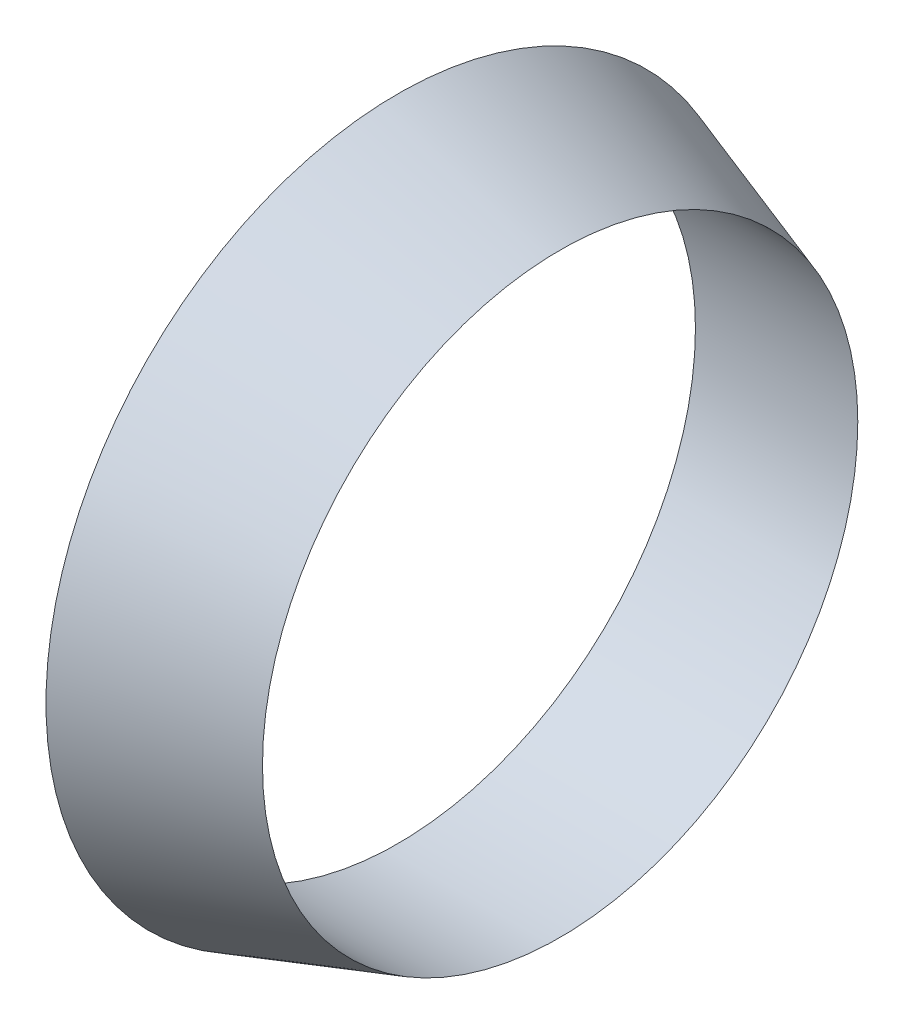
ISO-10303-21;
HEADER;
FILE_DESCRIPTION(('STEP AP214'),'2;1');
FILE_NAME('part.step','',(''),(''),'','','');
FILE_SCHEMA(('AUTOMOTIVE_DESIGN { 1 0 10303 214 1 1 1 1 }'));
ENDSEC;
DATA;
#1=APPLICATION_CONTEXT('core data for automotive mechanical design processes');
#2=APPLICATION_PROTOCOL_DEFINITION('international standard','automotive_design',2000,#1);
#3=PRODUCT_CONTEXT('',#1,'mechanical');
#4=PRODUCT('Part','Part','',(#3));
#5=PRODUCT_RELATED_PRODUCT_CATEGORY('part','',(#4));
#6=PRODUCT_DEFINITION_FORMATION('','',#4);
#7=PRODUCT_DEFINITION_CONTEXT('part definition',#1,'design');
#8=PRODUCT_DEFINITION('design','',#6,#7);
#9=PRODUCT_DEFINITION_SHAPE('','',#8);
#10=(LENGTH_UNIT() NAMED_UNIT(*) SI_UNIT(.MILLI.,.METRE.));
#11=(NAMED_UNIT(*) PLANE_ANGLE_UNIT() SI_UNIT($,.RADIAN.));
#12=(NAMED_UNIT(*) SI_UNIT($,.STERADIAN.) SOLID_ANGLE_UNIT());
#13=UNCERTAINTY_MEASURE_WITH_UNIT(LENGTH_MEASURE(1.E-05),#10,'distance_accuracy_value','');
#14=(GEOMETRIC_REPRESENTATION_CONTEXT(3) GLOBAL_UNCERTAINTY_ASSIGNED_CONTEXT((#13)) GLOBAL_UNIT_ASSIGNED_CONTEXT((#10,
#11,#12)) REPRESENTATION_CONTEXT('',''));
#15=CARTESIAN_POINT('',(0.,0.,0.));
#16=DIRECTION('',(0.,0.,1.));
#17=DIRECTION('',(1.,0.,0.));
#18=AXIS2_PLACEMENT_3D('',#15,#16,#17);
#19=CARTESIAN_POINT('',(0.,0.,0.));
#20=DIRECTION('',(1.,0.,0.));
#21=DIRECTION('',(0.,0.,-1.));
#22=AXIS2_PLACEMENT_3D('',#19,#20,#21);
#23=PLANE('',#22);
#24=CARTESIAN_POINT('',(0.,0.,0.));
#25=DIRECTION('',(1.,0.,0.));
#26=DIRECTION('',(0.,0.,-1.));
#27=AXIS2_PLACEMENT_3D('',#24,#25,#26);
#28=CIRCLE('',#27,55.);
#29=CARTESIAN_POINT('',(0.,0.,-55.));
#30=VERTEX_POINT('',#29);
#31=EDGE_CURVE('E52',#30,#30,#28,.T.);
#32=ORIENTED_EDGE('',*,*,#31,.T.);
#33=EDGE_LOOP('',(#32));
#34=FACE_BOUND('',#33,.T.);
#35=CARTESIAN_POINT('',(0.,0.,0.));
#36=DIRECTION('',(1.,0.,0.));
#37=DIRECTION('',(0.,0.,-1.));
#38=AXIS2_PLACEMENT_3D('',#35,#36,#37);
#39=CIRCLE('',#38,65.);
#40=CARTESIAN_POINT('',(0.,0.,-65.));
#41=VERTEX_POINT('',#40);
#42=EDGE_CURVE('E11',#41,#41,#39,.T.);
#43=ORIENTED_EDGE('',*,*,#42,.F.);
#44=EDGE_LOOP('',(#43));
#45=FACE_BOUND('',#44,.T.);
#46=ADVANCED_FACE('F42',(#34,#45),#23,.F.);
#47=CARTESIAN_POINT('',(30.,0.,0.));
#48=DIRECTION('',(-1.,0.,0.));
#49=DIRECTION('',(0.,0.,1.));
#50=AXIS2_PLACEMENT_3D('',#47,#48,#49);
#51=CONICAL_SURFACE('',#50,55.,0.321750554396642);
#52=ORIENTED_EDGE('',*,*,#42,.T.);
#53=EDGE_LOOP('',(#52));
#54=FACE_BOUND('',#53,.T.);
#55=CARTESIAN_POINT('',(30.,0.,0.));
#56=DIRECTION('',(1.,0.,0.));
#57=DIRECTION('',(0.,0.,-1.));
#58=AXIS2_PLACEMENT_3D('',#55,#56,#57);
#59=CIRCLE('',#58,55.);
#60=CARTESIAN_POINT('',(30.,0.,-55.));
#61=VERTEX_POINT('',#60);
#62=EDGE_CURVE('E60',#61,#61,#59,.T.);
#63=ORIENTED_EDGE('',*,*,#62,.F.);
#64=EDGE_LOOP('',(#63));
#65=FACE_BOUND('',#64,.T.);
#66=ADVANCED_FACE('F44',(#54,#65),#51,.T.);
#67=CARTESIAN_POINT('',(-9.99999999994061E-05,0.,0.));
#68=DIRECTION('',(1.,0.,0.));
#69=DIRECTION('',(0.,0.,-1.));
#70=AXIS2_PLACEMENT_3D('',#67,#68,#69);
#71=CYLINDRICAL_SURFACE('',#70,55.);
#72=ORIENTED_EDGE('',*,*,#62,.T.);
#73=EDGE_LOOP('',(#72));
#74=FACE_BOUND('',#73,.T.);
#75=ORIENTED_EDGE('',*,*,#31,.F.);
#76=EDGE_LOOP('',(#75));
#77=FACE_BOUND('',#76,.T.);
#78=ADVANCED_FACE('F76',(#74,#77),#71,.F.);
#79=CLOSED_SHELL('',(#46,#66,#78));
#80=MANIFOLD_SOLID_BREP('B2',#79);
#81=ADVANCED_BREP_SHAPE_REPRESENTATION('',(#18,#80),#14);
#82=SHAPE_DEFINITION_REPRESENTATION(#9,#81);
ENDSEC;
END-ISO-10303-21;
